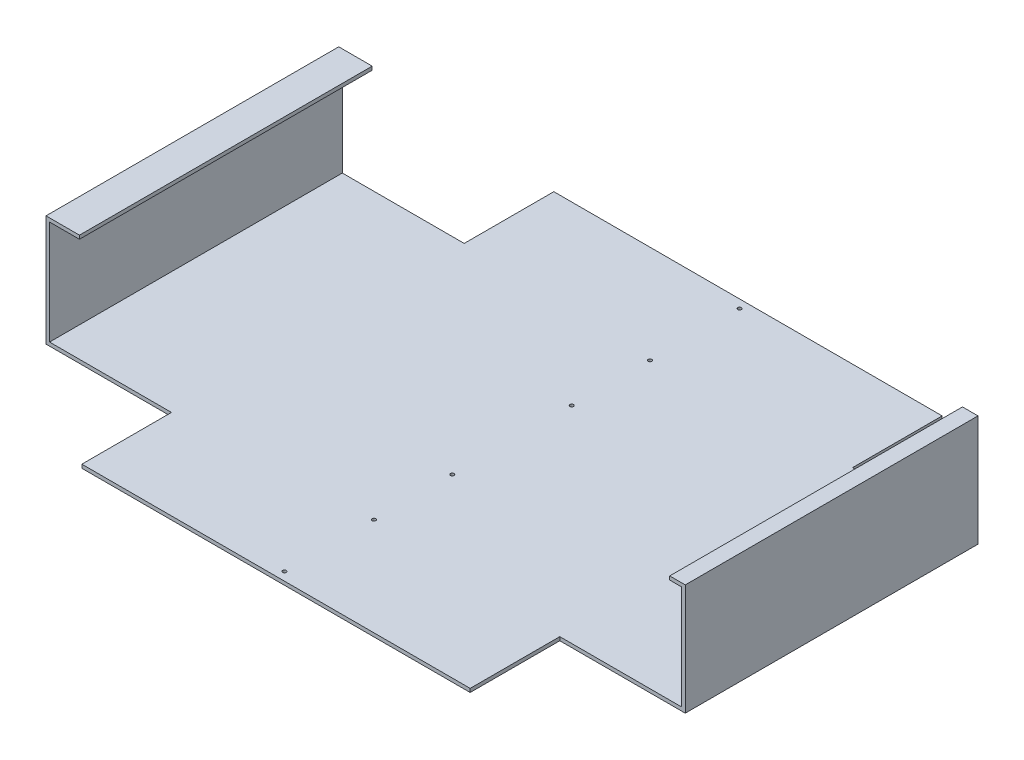
ISO-10303-21;
HEADER;
FILE_DESCRIPTION(('STEP AP214'),'2;1');
FILE_NAME('part.step','',(''),(''),'','','');
FILE_SCHEMA(('AUTOMOTIVE_DESIGN { 1 0 10303 214 1 1 1 1 }'));
ENDSEC;
DATA;
#1=APPLICATION_CONTEXT('core data for automotive mechanical design processes');
#2=APPLICATION_PROTOCOL_DEFINITION('international standard','automotive_design',2000,#1);
#3=PRODUCT_CONTEXT('',#1,'mechanical');
#4=PRODUCT('Part','Part','',(#3));
#5=PRODUCT_RELATED_PRODUCT_CATEGORY('part','',(#4));
#6=PRODUCT_DEFINITION_FORMATION('','',#4);
#7=PRODUCT_DEFINITION_CONTEXT('part definition',#1,'design');
#8=PRODUCT_DEFINITION('design','',#6,#7);
#9=PRODUCT_DEFINITION_SHAPE('','',#8);
#10=(LENGTH_UNIT() NAMED_UNIT(*) SI_UNIT(.MILLI.,.METRE.));
#11=(NAMED_UNIT(*) PLANE_ANGLE_UNIT() SI_UNIT($,.RADIAN.));
#12=(NAMED_UNIT(*) SI_UNIT($,.STERADIAN.) SOLID_ANGLE_UNIT());
#13=UNCERTAINTY_MEASURE_WITH_UNIT(LENGTH_MEASURE(1.E-05),#10,'distance_accuracy_value','');
#14=(GEOMETRIC_REPRESENTATION_CONTEXT(3) GLOBAL_UNCERTAINTY_ASSIGNED_CONTEXT((#13)) GLOBAL_UNIT_ASSIGNED_CONTEXT((#10,
#11,#12)) REPRESENTATION_CONTEXT('',''));
#15=CARTESIAN_POINT('',(0.,0.,0.));
#16=DIRECTION('',(0.,0.,1.));
#17=DIRECTION('',(1.,0.,0.));
#18=AXIS2_PLACEMENT_3D('',#15,#16,#17);
#19=CARTESIAN_POINT('',(264.5,93.,-122.5));
#20=DIRECTION('',(1.,0.,0.));
#21=DIRECTION('',(0.,0.,-1.));
#22=AXIS2_PLACEMENT_3D('',#19,#20,#21);
#23=PLANE('',#22);
#24=DIRECTION('',(0.,0.,1.));
#25=VECTOR('',#24,1.);
#26=CARTESIAN_POINT('',(264.5,90.,-122.5));
#27=LINE('',#26,#25);
#28=CARTESIAN_POINT('',(264.5,90.,-122.5));
#29=VERTEX_POINT('',#28);
#30=CARTESIAN_POINT('',(264.5,90.,122.5));
#31=VERTEX_POINT('',#30);
#32=EDGE_CURVE('E206',#29,#31,#27,.T.);
#33=ORIENTED_EDGE('',*,*,#32,.F.);
#34=DIRECTION('',(0.,-1.,0.));
#35=VECTOR('',#34,1.);
#36=CARTESIAN_POINT('',(264.5,93.,-122.5));
#37=LINE('',#36,#35);
#38=CARTESIAN_POINT('',(264.5,3.,-122.5));
#39=VERTEX_POINT('',#38);
#40=EDGE_CURVE('E211',#29,#39,#37,.T.);
#41=ORIENTED_EDGE('',*,*,#40,.T.);
#42=DIRECTION('',(0.,0.,1.));
#43=VECTOR('',#42,1.);
#44=CARTESIAN_POINT('',(264.5,3.,-122.5));
#45=LINE('',#44,#43);
#46=CARTESIAN_POINT('',(264.5,3.,122.5));
#47=VERTEX_POINT('',#46);
#48=EDGE_CURVE('E213',#39,#47,#45,.T.);
#49=ORIENTED_EDGE('',*,*,#48,.T.);
#50=DIRECTION('',(0.,-1.,0.));
#51=VECTOR('',#50,1.);
#52=CARTESIAN_POINT('',(264.5,93.,122.5));
#53=LINE('',#52,#51);
#54=EDGE_CURVE('E60',#31,#47,#53,.T.);
#55=ORIENTED_EDGE('',*,*,#54,.F.);
#56=EDGE_LOOP('',(#33,#41,#49,#55));
#57=FACE_BOUND('',#56,.T.);
#58=ADVANCED_FACE('F42',(#57),#23,.F.);
#59=CARTESIAN_POINT('',(0.,3.,0.));
#60=DIRECTION('',(0.,-1.,0.));
#61=DIRECTION('',(0.,0.,-1.));
#62=AXIS2_PLACEMENT_3D('',#59,#60,#61);
#63=PLANE('',#62);
#64=CARTESIAN_POINT('',(0.,3.,-115.5));
#65=DIRECTION('',(0.,-1.,0.));
#66=DIRECTION('',(0.,0.,-1.));
#67=AXIS2_PLACEMENT_3D('',#64,#65,#66);
#68=CIRCLE('',#67,1.5);
#69=CARTESIAN_POINT('',(0.,3.,-117.));
#70=VERTEX_POINT('',#69);
#71=EDGE_CURVE('E512',#70,#70,#68,.T.);
#72=ORIENTED_EDGE('',*,*,#71,.T.);
#73=EDGE_LOOP('',(#72));
#74=FACE_BOUND('',#73,.T.);
#75=CARTESIAN_POINT('',(0.,3.,-190.5));
#76=DIRECTION('',(0.,-1.,0.));
#77=DIRECTION('',(0.,0.,-1.));
#78=AXIS2_PLACEMENT_3D('',#75,#76,#77);
#79=CIRCLE('',#78,1.5);
#80=CARTESIAN_POINT('',(0.,3.,-192.));
#81=VERTEX_POINT('',#80);
#82=EDGE_CURVE('E504',#81,#81,#79,.T.);
#83=ORIENTED_EDGE('',*,*,#82,.T.);
#84=EDGE_LOOP('',(#83));
#85=FACE_BOUND('',#84,.T.);
#86=CARTESIAN_POINT('',(0.,3.,115.5));
#87=DIRECTION('',(0.,1.,0.));
#88=DIRECTION('',(0.,0.,1.));
#89=AXIS2_PLACEMENT_3D('',#86,#87,#88);
#90=CIRCLE('',#89,1.5);
#91=CARTESIAN_POINT('',(0.,3.,117.));
#92=VERTEX_POINT('',#91);
#93=EDGE_CURVE('E496',#92,#92,#90,.T.);
#94=ORIENTED_EDGE('',*,*,#93,.F.);
#95=EDGE_LOOP('',(#94));
#96=FACE_BOUND('',#95,.T.);
#97=CARTESIAN_POINT('',(0.,3.,190.5));
#98=DIRECTION('',(0.,1.,0.));
#99=DIRECTION('',(0.,0.,1.));
#100=AXIS2_PLACEMENT_3D('',#97,#98,#99);
#101=CIRCLE('',#100,1.5);
#102=CARTESIAN_POINT('',(0.,3.,192.));
#103=VERTEX_POINT('',#102);
#104=EDGE_CURVE('E476',#103,#103,#101,.T.);
#105=ORIENTED_EDGE('',*,*,#104,.F.);
#106=EDGE_LOOP('',(#105));
#107=FACE_BOUND('',#106,.T.);
#108=CARTESIAN_POINT('',(0.,3.,-50.));
#109=DIRECTION('',(0.,1.,0.));
#110=DIRECTION('',(0.,0.,1.));
#111=AXIS2_PLACEMENT_3D('',#108,#109,#110);
#112=CIRCLE('',#111,1.5);
#113=CARTESIAN_POINT('',(0.,3.,-48.5));
#114=VERTEX_POINT('',#113);
#115=EDGE_CURVE('E467',#114,#114,#112,.T.);
#116=ORIENTED_EDGE('',*,*,#115,.F.);
#117=EDGE_LOOP('',(#116));
#118=FACE_BOUND('',#117,.T.);
#119=CARTESIAN_POINT('',(0.,3.,50.));
#120=DIRECTION('',(0.,1.,0.));
#121=DIRECTION('',(0.,0.,1.));
#122=AXIS2_PLACEMENT_3D('',#119,#120,#121);
#123=CIRCLE('',#122,1.5);
#124=CARTESIAN_POINT('',(0.,3.,51.5));
#125=VERTEX_POINT('',#124);
#126=EDGE_CURVE('E473',#125,#125,#123,.T.);
#127=ORIENTED_EDGE('',*,*,#126,.F.);
#128=EDGE_LOOP('',(#127));
#129=FACE_BOUND('',#128,.T.);
#130=ORIENTED_EDGE('',*,*,#48,.F.);
#131=DIRECTION('',(-1.,0.,0.));
#132=VECTOR('',#131,1.);
#133=CARTESIAN_POINT('',(267.5,3.,-122.5));
#134=LINE('',#133,#132);
#135=CARTESIAN_POINT('',(162.499999999994,3.,-122.5));
#136=VERTEX_POINT('',#135);
#137=EDGE_CURVE('E310',#39,#136,#134,.T.);
#138=ORIENTED_EDGE('',*,*,#137,.T.);
#139=DIRECTION('',(0.,0.,-1.));
#140=VECTOR('',#139,1.);
#141=CARTESIAN_POINT('',(162.499999999994,3.,-197.5));
#142=LINE('',#141,#140);
#143=CARTESIAN_POINT('',(162.499999999994,3.,-197.5));
#144=VERTEX_POINT('',#143);
#145=EDGE_CURVE('E299',#136,#144,#142,.T.);
#146=ORIENTED_EDGE('',*,*,#145,.T.);
#147=DIRECTION('',(-1.,0.,0.));
#148=VECTOR('',#147,1.);
#149=CARTESIAN_POINT('',(-267.5,3.,-197.5));
#150=LINE('',#149,#148);
#151=CARTESIAN_POINT('',(-162.499999999994,3.,-197.5));
#152=VERTEX_POINT('',#151);
#153=EDGE_CURVE('E52',#144,#152,#150,.T.);
#154=ORIENTED_EDGE('',*,*,#153,.T.);
#155=DIRECTION('',(0.,0.,-1.));
#156=VECTOR('',#155,1.);
#157=CARTESIAN_POINT('',(-162.499999999994,3.,-197.5));
#158=LINE('',#157,#156);
#159=CARTESIAN_POINT('',(-162.499999999994,3.,-122.5));
#160=VERTEX_POINT('',#159);
#161=EDGE_CURVE('E358',#160,#152,#158,.T.);
#162=ORIENTED_EDGE('',*,*,#161,.F.);
#163=DIRECTION('',(1.,0.,0.));
#164=VECTOR('',#163,1.);
#165=CARTESIAN_POINT('',(-267.5,3.,-122.5));
#166=LINE('',#165,#164);
#167=CARTESIAN_POINT('',(-264.5,3.,-122.5));
#168=VERTEX_POINT('',#167);
#169=EDGE_CURVE('E346',#168,#160,#166,.T.);
#170=ORIENTED_EDGE('',*,*,#169,.F.);
#171=DIRECTION('',(0.,0.,-1.));
#172=VECTOR('',#171,1.);
#173=CARTESIAN_POINT('',(-264.5,3.,-122.5));
#174=LINE('',#173,#172);
#175=CARTESIAN_POINT('',(-264.5,3.,122.5));
#176=VERTEX_POINT('',#175);
#177=EDGE_CURVE('E261',#176,#168,#174,.T.);
#178=ORIENTED_EDGE('',*,*,#177,.F.);
#179=DIRECTION('',(1.,0.,0.));
#180=VECTOR('',#179,1.);
#181=CARTESIAN_POINT('',(-267.5,3.,122.5));
#182=LINE('',#181,#180);
#183=CARTESIAN_POINT('',(-162.499999999994,3.,122.5));
#184=VERTEX_POINT('',#183);
#185=EDGE_CURVE('E333',#176,#184,#182,.T.);
#186=ORIENTED_EDGE('',*,*,#185,.T.);
#187=DIRECTION('',(0.,0.,1.));
#188=VECTOR('',#187,1.);
#189=CARTESIAN_POINT('',(-162.499999999994,3.,197.5));
#190=LINE('',#189,#188);
#191=CARTESIAN_POINT('',(-162.499999999994,3.,197.5));
#192=VERTEX_POINT('',#191);
#193=EDGE_CURVE('E322',#184,#192,#190,.T.);
#194=ORIENTED_EDGE('',*,*,#193,.T.);
#195=DIRECTION('',(1.,0.,0.));
#196=VECTOR('',#195,1.);
#197=CARTESIAN_POINT('',(-267.5,3.,197.5));
#198=LINE('',#197,#196);
#199=CARTESIAN_POINT('',(162.499999999994,3.,197.5));
#200=VERTEX_POINT('',#199);
#201=EDGE_CURVE('E11',#192,#200,#198,.T.);
#202=ORIENTED_EDGE('',*,*,#201,.T.);
#203=DIRECTION('',(0.,0.,1.));
#204=VECTOR('',#203,1.);
#205=CARTESIAN_POINT('',(162.499999999994,3.,197.5));
#206=LINE('',#205,#204);
#207=CARTESIAN_POINT('',(162.499999999994,3.,122.5));
#208=VERTEX_POINT('',#207);
#209=EDGE_CURVE('E286',#208,#200,#206,.T.);
#210=ORIENTED_EDGE('',*,*,#209,.F.);
#211=DIRECTION('',(-1.,0.,0.));
#212=VECTOR('',#211,1.);
#213=CARTESIAN_POINT('',(267.5,3.,122.5));
#214=LINE('',#213,#212);
#215=EDGE_CURVE('E280',#47,#208,#214,.T.);
#216=ORIENTED_EDGE('',*,*,#215,.F.);
#217=EDGE_LOOP('',(#130,#138,#146,#154,#162,#170,#178,#186,#194,#202,#210,#216));
#218=FACE_BOUND('',#217,.T.);
#219=ADVANCED_FACE('F410',(#74,#85,#96,#107,#118,#129,#218),#63,.F.);
#220=CARTESIAN_POINT('',(-264.5,93.,-122.5));
#221=DIRECTION('',(-1.,0.,0.));
#222=DIRECTION('',(0.,0.,1.));
#223=AXIS2_PLACEMENT_3D('',#220,#221,#222);
#224=PLANE('',#223);
#225=DIRECTION('',(0.,0.,-1.));
#226=VECTOR('',#225,1.);
#227=CARTESIAN_POINT('',(-264.5,90.,122.5));
#228=LINE('',#227,#226);
#229=CARTESIAN_POINT('',(-264.5,90.,122.5));
#230=VERTEX_POINT('',#229);
#231=CARTESIAN_POINT('',(-264.5,90.,-122.5));
#232=VERTEX_POINT('',#231);
#233=EDGE_CURVE('E236',#230,#232,#228,.T.);
#234=ORIENTED_EDGE('',*,*,#233,.F.);
#235=DIRECTION('',(0.,-1.,0.));
#236=VECTOR('',#235,1.);
#237=CARTESIAN_POINT('',(-264.5,93.,122.5));
#238=LINE('',#237,#236);
#239=EDGE_CURVE('E68',#230,#176,#238,.T.);
#240=ORIENTED_EDGE('',*,*,#239,.T.);
#241=ORIENTED_EDGE('',*,*,#177,.T.);
#242=DIRECTION('',(0.,-1.,0.));
#243=VECTOR('',#242,1.);
#244=CARTESIAN_POINT('',(-264.5,93.,-122.5));
#245=LINE('',#244,#243);
#246=EDGE_CURVE('E273',#232,#168,#245,.T.);
#247=ORIENTED_EDGE('',*,*,#246,.F.);
#248=EDGE_LOOP('',(#234,#240,#241,#247));
#249=FACE_BOUND('',#248,.T.);
#250=ADVANCED_FACE('F437',(#249),#224,.F.);
#251=CARTESIAN_POINT('',(0.,0.,0.));
#252=DIRECTION('',(0.,-1.,0.));
#253=DIRECTION('',(0.,0.,-1.));
#254=AXIS2_PLACEMENT_3D('',#251,#252,#253);
#255=PLANE('',#254);
#256=CARTESIAN_POINT('',(0.,0.,-115.5));
#257=DIRECTION('',(0.,-1.,0.));
#258=DIRECTION('',(0.,0.,-1.));
#259=AXIS2_PLACEMENT_3D('',#256,#257,#258);
#260=CIRCLE('',#259,1.5);
#261=CARTESIAN_POINT('',(0.,0.,-117.));
#262=VERTEX_POINT('',#261);
#263=EDGE_CURVE('E508',#262,#262,#260,.T.);
#264=ORIENTED_EDGE('',*,*,#263,.F.);
#265=EDGE_LOOP('',(#264));
#266=FACE_BOUND('',#265,.T.);
#267=CARTESIAN_POINT('',(0.,0.,-190.5));
#268=DIRECTION('',(0.,-1.,0.));
#269=DIRECTION('',(0.,0.,-1.));
#270=AXIS2_PLACEMENT_3D('',#267,#268,#269);
#271=CIRCLE('',#270,1.5);
#272=CARTESIAN_POINT('',(0.,0.,-192.));
#273=VERTEX_POINT('',#272);
#274=EDGE_CURVE('E500',#273,#273,#271,.T.);
#275=ORIENTED_EDGE('',*,*,#274,.F.);
#276=EDGE_LOOP('',(#275));
#277=FACE_BOUND('',#276,.T.);
#278=CARTESIAN_POINT('',(0.,0.,115.5));
#279=DIRECTION('',(0.,1.,0.));
#280=DIRECTION('',(0.,0.,1.));
#281=AXIS2_PLACEMENT_3D('',#278,#279,#280);
#282=CIRCLE('',#281,1.5);
#283=CARTESIAN_POINT('',(0.,0.,117.));
#284=VERTEX_POINT('',#283);
#285=EDGE_CURVE('E494',#284,#284,#282,.T.);
#286=ORIENTED_EDGE('',*,*,#285,.T.);
#287=EDGE_LOOP('',(#286));
#288=FACE_BOUND('',#287,.T.);
#289=CARTESIAN_POINT('',(0.,0.,190.5));
#290=DIRECTION('',(0.,1.,0.));
#291=DIRECTION('',(0.,0.,1.));
#292=AXIS2_PLACEMENT_3D('',#289,#290,#291);
#293=CIRCLE('',#292,1.5);
#294=CARTESIAN_POINT('',(0.,0.,192.));
#295=VERTEX_POINT('',#294);
#296=EDGE_CURVE('E485',#295,#295,#293,.T.);
#297=ORIENTED_EDGE('',*,*,#296,.T.);
#298=EDGE_LOOP('',(#297));
#299=FACE_BOUND('',#298,.T.);
#300=CARTESIAN_POINT('',(0.,0.,-50.));
#301=DIRECTION('',(0.,1.,0.));
#302=DIRECTION('',(0.,0.,1.));
#303=AXIS2_PLACEMENT_3D('',#300,#301,#302);
#304=CIRCLE('',#303,1.5);
#305=CARTESIAN_POINT('',(0.,0.,-48.5));
#306=VERTEX_POINT('',#305);
#307=EDGE_CURVE('E464',#306,#306,#304,.T.);
#308=ORIENTED_EDGE('',*,*,#307,.T.);
#309=EDGE_LOOP('',(#308));
#310=FACE_BOUND('',#309,.T.);
#311=CARTESIAN_POINT('',(0.,0.,50.));
#312=DIRECTION('',(0.,1.,0.));
#313=DIRECTION('',(0.,0.,1.));
#314=AXIS2_PLACEMENT_3D('',#311,#312,#313);
#315=CIRCLE('',#314,1.5);
#316=CARTESIAN_POINT('',(0.,0.,51.5));
#317=VERTEX_POINT('',#316);
#318=EDGE_CURVE('E482',#317,#317,#315,.T.);
#319=ORIENTED_EDGE('',*,*,#318,.T.);
#320=EDGE_LOOP('',(#319));
#321=FACE_BOUND('',#320,.T.);
#322=DIRECTION('',(0.,0.,1.));
#323=VECTOR('',#322,1.);
#324=CARTESIAN_POINT('',(162.499999999994,0.,197.5));
#325=LINE('',#324,#323);
#326=CARTESIAN_POINT('',(162.499999999994,0.,122.5));
#327=VERTEX_POINT('',#326);
#328=CARTESIAN_POINT('',(162.499999999994,0.,197.5));
#329=VERTEX_POINT('',#328);
#330=EDGE_CURVE('E285',#327,#329,#325,.T.);
#331=ORIENTED_EDGE('',*,*,#330,.T.);
#332=DIRECTION('',(1.,0.,0.));
#333=VECTOR('',#332,1.);
#334=CARTESIAN_POINT('',(-267.5,0.,197.5));
#335=LINE('',#334,#333);
#336=CARTESIAN_POINT('',(-162.499999999994,0.,197.5));
#337=VERTEX_POINT('',#336);
#338=EDGE_CURVE('E46',#337,#329,#335,.T.);
#339=ORIENTED_EDGE('',*,*,#338,.F.);
#340=DIRECTION('',(0.,0.,1.));
#341=VECTOR('',#340,1.);
#342=CARTESIAN_POINT('',(-162.499999999994,0.,197.5));
#343=LINE('',#342,#341);
#344=CARTESIAN_POINT('',(-162.499999999994,0.,122.5));
#345=VERTEX_POINT('',#344);
#346=EDGE_CURVE('E329',#345,#337,#343,.T.);
#347=ORIENTED_EDGE('',*,*,#346,.F.);
#348=DIRECTION('',(1.,0.,0.));
#349=VECTOR('',#348,1.);
#350=CARTESIAN_POINT('',(-267.5,0.,122.5));
#351=LINE('',#350,#349);
#352=CARTESIAN_POINT('',(-267.5,0.,122.5));
#353=VERTEX_POINT('',#352);
#354=EDGE_CURVE('E332',#353,#345,#351,.T.);
#355=ORIENTED_EDGE('',*,*,#354,.F.);
#356=DIRECTION('',(0.,0.,1.));
#357=VECTOR('',#356,1.);
#358=CARTESIAN_POINT('',(-267.5,0.,197.5));
#359=LINE('',#358,#357);
#360=CARTESIAN_POINT('',(-267.5,0.,-122.5));
#361=VERTEX_POINT('',#360);
#362=EDGE_CURVE('E385',#361,#353,#359,.T.);
#363=ORIENTED_EDGE('',*,*,#362,.F.);
#364=DIRECTION('',(1.,0.,0.));
#365=VECTOR('',#364,1.);
#366=CARTESIAN_POINT('',(-267.5,0.,-122.5));
#367=LINE('',#366,#365);
#368=CARTESIAN_POINT('',(-162.499999999994,0.,-122.5));
#369=VERTEX_POINT('',#368);
#370=EDGE_CURVE('E353',#361,#369,#367,.T.);
#371=ORIENTED_EDGE('',*,*,#370,.T.);
#372=DIRECTION('',(0.,0.,-1.));
#373=VECTOR('',#372,1.);
#374=CARTESIAN_POINT('',(-162.499999999994,0.,-197.5));
#375=LINE('',#374,#373);
#376=CARTESIAN_POINT('',(-162.499999999994,0.,-197.5));
#377=VERTEX_POINT('',#376);
#378=EDGE_CURVE('E357',#369,#377,#375,.T.);
#379=ORIENTED_EDGE('',*,*,#378,.T.);
#380=DIRECTION('',(-1.,0.,0.));
#381=VECTOR('',#380,1.);
#382=CARTESIAN_POINT('',(-267.5,0.,-197.5));
#383=LINE('',#382,#381);
#384=CARTESIAN_POINT('',(162.499999999994,0.,-197.5));
#385=VERTEX_POINT('',#384);
#386=EDGE_CURVE('E383',#385,#377,#383,.T.);
#387=ORIENTED_EDGE('',*,*,#386,.F.);
#388=DIRECTION('',(0.,0.,-1.));
#389=VECTOR('',#388,1.);
#390=CARTESIAN_POINT('',(162.499999999994,0.,-197.5));
#391=LINE('',#390,#389);
#392=CARTESIAN_POINT('',(162.499999999994,0.,-122.5));
#393=VERTEX_POINT('',#392);
#394=EDGE_CURVE('E306',#393,#385,#391,.T.);
#395=ORIENTED_EDGE('',*,*,#394,.F.);
#396=DIRECTION('',(-1.,0.,0.));
#397=VECTOR('',#396,1.);
#398=CARTESIAN_POINT('',(267.5,0.,-122.5));
#399=LINE('',#398,#397);
#400=CARTESIAN_POINT('',(267.5,0.,-122.5));
#401=VERTEX_POINT('',#400);
#402=EDGE_CURVE('E309',#401,#393,#399,.T.);
#403=ORIENTED_EDGE('',*,*,#402,.F.);
#404=DIRECTION('',(0.,0.,-1.));
#405=VECTOR('',#404,1.);
#406=CARTESIAN_POINT('',(267.5,0.,197.5));
#407=LINE('',#406,#405);
#408=CARTESIAN_POINT('',(267.5,0.,122.5));
#409=VERTEX_POINT('',#408);
#410=EDGE_CURVE('E372',#409,#401,#407,.T.);
#411=ORIENTED_EDGE('',*,*,#410,.F.);
#412=DIRECTION('',(-1.,0.,0.));
#413=VECTOR('',#412,1.);
#414=CARTESIAN_POINT('',(267.5,0.,122.5));
#415=LINE('',#414,#413);
#416=EDGE_CURVE('E281',#409,#327,#415,.T.);
#417=ORIENTED_EDGE('',*,*,#416,.T.);
#418=EDGE_LOOP('',(#331,#339,#347,#355,#363,#371,#379,#387,#395,#403,#411,#417));
#419=FACE_BOUND('',#418,.T.);
#420=ADVANCED_FACE('F400',(#266,#277,#288,#299,#310,#321,#419),#255,.T.);
#421=CARTESIAN_POINT('',(267.5,3.,197.5));
#422=DIRECTION('',(-1.,0.,0.));
#423=DIRECTION('',(0.,0.,1.));
#424=AXIS2_PLACEMENT_3D('',#421,#422,#423);
#425=PLANE('',#424);
#426=DIRECTION('',(0.,1.,0.));
#427=VECTOR('',#426,1.);
#428=CARTESIAN_POINT('',(267.5,0.,-122.5));
#429=LINE('',#428,#427);
#430=CARTESIAN_POINT('',(267.5,93.,-122.5));
#431=VERTEX_POINT('',#430);
#432=EDGE_CURVE('E319',#401,#431,#429,.T.);
#433=ORIENTED_EDGE('',*,*,#432,.T.);
#434=DIRECTION('',(0.,0.,-1.));
#435=VECTOR('',#434,1.);
#436=CARTESIAN_POINT('',(267.5,93.,-122.5));
#437=LINE('',#436,#435);
#438=CARTESIAN_POINT('',(267.5,93.,122.5));
#439=VERTEX_POINT('',#438);
#440=EDGE_CURVE('E217',#439,#431,#437,.T.);
#441=ORIENTED_EDGE('',*,*,#440,.F.);
#442=DIRECTION('',(0.,1.,0.));
#443=VECTOR('',#442,1.);
#444=CARTESIAN_POINT('',(267.5,0.,122.5));
#445=LINE('',#444,#443);
#446=EDGE_CURVE('E290',#409,#439,#445,.T.);
#447=ORIENTED_EDGE('',*,*,#446,.F.);
#448=ORIENTED_EDGE('',*,*,#410,.T.);
#449=EDGE_LOOP('',(#433,#441,#447,#448));
#450=FACE_BOUND('',#449,.T.);
#451=ADVANCED_FACE('F44',(#450),#425,.F.);
#452=CARTESIAN_POINT('',(-267.5,3.,-197.5));
#453=DIRECTION('',(0.,0.,1.));
#454=DIRECTION('',(1.,0.,0.));
#455=AXIS2_PLACEMENT_3D('',#452,#453,#454);
#456=PLANE('',#455);
#457=DIRECTION('',(0.,1.,0.));
#458=VECTOR('',#457,1.);
#459=CARTESIAN_POINT('',(162.499999999994,0.,-197.5));
#460=LINE('',#459,#458);
#461=EDGE_CURVE('E313',#385,#144,#460,.T.);
#462=ORIENTED_EDGE('',*,*,#461,.F.);
#463=ORIENTED_EDGE('',*,*,#386,.T.);
#464=DIRECTION('',(0.,1.,0.));
#465=VECTOR('',#464,1.);
#466=CARTESIAN_POINT('',(-162.499999999994,0.,-197.5));
#467=LINE('',#466,#465);
#468=EDGE_CURVE('E368',#377,#152,#467,.T.);
#469=ORIENTED_EDGE('',*,*,#468,.T.);
#470=ORIENTED_EDGE('',*,*,#153,.F.);
#471=EDGE_LOOP('',(#462,#463,#469,#470));
#472=FACE_BOUND('',#471,.T.);
#473=ADVANCED_FACE('F445',(#472),#456,.F.);
#474=CARTESIAN_POINT('',(-267.5,3.,197.5));
#475=DIRECTION('',(1.,0.,0.));
#476=DIRECTION('',(0.,0.,-1.));
#477=AXIS2_PLACEMENT_3D('',#474,#475,#476);
#478=PLANE('',#477);
#479=DIRECTION('',(0.,1.,0.));
#480=VECTOR('',#479,1.);
#481=CARTESIAN_POINT('',(-267.5,0.,122.5));
#482=LINE('',#481,#480);
#483=CARTESIAN_POINT('',(-267.5,93.,122.5));
#484=VERTEX_POINT('',#483);
#485=EDGE_CURVE('E343',#353,#484,#482,.T.);
#486=ORIENTED_EDGE('',*,*,#485,.T.);
#487=DIRECTION('',(0.,0.,1.));
#488=VECTOR('',#487,1.);
#489=CARTESIAN_POINT('',(-267.5,93.,-122.5));
#490=LINE('',#489,#488);
#491=CARTESIAN_POINT('',(-267.5,93.,-122.5));
#492=VERTEX_POINT('',#491);
#493=EDGE_CURVE('E262',#492,#484,#490,.T.);
#494=ORIENTED_EDGE('',*,*,#493,.F.);
#495=DIRECTION('',(0.,1.,0.));
#496=VECTOR('',#495,1.);
#497=CARTESIAN_POINT('',(-267.5,0.,-122.5));
#498=LINE('',#497,#496);
#499=EDGE_CURVE('E362',#361,#492,#498,.T.);
#500=ORIENTED_EDGE('',*,*,#499,.F.);
#501=ORIENTED_EDGE('',*,*,#362,.T.);
#502=EDGE_LOOP('',(#486,#494,#500,#501));
#503=FACE_BOUND('',#502,.T.);
#504=ADVANCED_FACE('F423',(#503),#478,.F.);
#505=CARTESIAN_POINT('',(-267.5,3.,197.5));
#506=DIRECTION('',(0.,0.,-1.));
#507=DIRECTION('',(-1.,0.,0.));
#508=AXIS2_PLACEMENT_3D('',#505,#506,#507);
#509=PLANE('',#508);
#510=ORIENTED_EDGE('',*,*,#338,.T.);
#511=DIRECTION('',(0.,1.,0.));
#512=VECTOR('',#511,1.);
#513=CARTESIAN_POINT('',(162.499999999994,0.,197.5));
#514=LINE('',#513,#512);
#515=EDGE_CURVE('E295',#329,#200,#514,.T.);
#516=ORIENTED_EDGE('',*,*,#515,.T.);
#517=ORIENTED_EDGE('',*,*,#201,.F.);
#518=DIRECTION('',(0.,1.,0.));
#519=VECTOR('',#518,1.);
#520=CARTESIAN_POINT('',(-162.499999999994,0.,197.5));
#521=LINE('',#520,#519);
#522=EDGE_CURVE('E337',#337,#192,#521,.T.);
#523=ORIENTED_EDGE('',*,*,#522,.F.);
#524=EDGE_LOOP('',(#510,#516,#517,#523));
#525=FACE_BOUND('',#524,.T.);
#526=ADVANCED_FACE('F396',(#525),#509,.F.);
#527=CARTESIAN_POINT('',(-162.499999999994,0.,-197.5));
#528=DIRECTION('',(1.,0.,0.));
#529=DIRECTION('',(0.,0.,-1.));
#530=AXIS2_PLACEMENT_3D('',#527,#528,#529);
#531=PLANE('',#530);
#532=ORIENTED_EDGE('',*,*,#161,.T.);
#533=ORIENTED_EDGE('',*,*,#468,.F.);
#534=ORIENTED_EDGE('',*,*,#378,.F.);
#535=DIRECTION('',(0.,1.,0.));
#536=VECTOR('',#535,1.);
#537=CARTESIAN_POINT('',(-162.499999999994,0.,-122.5));
#538=LINE('',#537,#536);
#539=EDGE_CURVE('E373',#369,#160,#538,.T.);
#540=ORIENTED_EDGE('',*,*,#539,.T.);
#541=EDGE_LOOP('',(#532,#533,#534,#540));
#542=FACE_BOUND('',#541,.T.);
#543=ADVANCED_FACE('F440',(#542),#531,.F.);
#544=CARTESIAN_POINT('',(-267.5,0.,-122.5));
#545=DIRECTION('',(0.,0.,1.));
#546=DIRECTION('',(1.,0.,0.));
#547=AXIS2_PLACEMENT_3D('',#544,#545,#546);
#548=PLANE('',#547);
#549=ORIENTED_EDGE('',*,*,#499,.T.);
#550=DIRECTION('',(-1.,0.,0.));
#551=VECTOR('',#550,1.);
#552=CARTESIAN_POINT('',(-267.5,93.,-122.5));
#553=LINE('',#552,#551);
#554=CARTESIAN_POINT('',(-239.5,93.,-122.5));
#555=VERTEX_POINT('',#554);
#556=EDGE_CURVE('E269',#555,#492,#553,.T.);
#557=ORIENTED_EDGE('',*,*,#556,.F.);
#558=DIRECTION('',(0.,1.,0.));
#559=VECTOR('',#558,1.);
#560=CARTESIAN_POINT('',(-239.5,93.,-122.5));
#561=LINE('',#560,#559);
#562=CARTESIAN_POINT('',(-239.5,90.,-122.5));
#563=VERTEX_POINT('',#562);
#564=EDGE_CURVE('E244',#563,#555,#561,.T.);
#565=ORIENTED_EDGE('',*,*,#564,.F.);
#566=DIRECTION('',(-1.,0.,0.));
#567=VECTOR('',#566,1.);
#568=CARTESIAN_POINT('',(-239.5,90.,-122.5));
#569=LINE('',#568,#567);
#570=EDGE_CURVE('E252',#563,#232,#569,.T.);
#571=ORIENTED_EDGE('',*,*,#570,.T.);
#572=ORIENTED_EDGE('',*,*,#246,.T.);
#573=ORIENTED_EDGE('',*,*,#169,.T.);
#574=ORIENTED_EDGE('',*,*,#539,.F.);
#575=ORIENTED_EDGE('',*,*,#370,.F.);
#576=EDGE_LOOP('',(#549,#557,#565,#571,#572,#573,#574,#575));
#577=FACE_BOUND('',#576,.T.);
#578=ADVANCED_FACE('F421',(#577),#548,.F.);
#579=CARTESIAN_POINT('',(-267.5,0.,122.5));
#580=DIRECTION('',(0.,0.,1.));
#581=DIRECTION('',(1.,0.,0.));
#582=AXIS2_PLACEMENT_3D('',#579,#580,#581);
#583=PLANE('',#582);
#584=ORIENTED_EDGE('',*,*,#185,.F.);
#585=ORIENTED_EDGE('',*,*,#239,.F.);
#586=DIRECTION('',(-1.,0.,0.));
#587=VECTOR('',#586,1.);
#588=CARTESIAN_POINT('',(-239.5,90.,122.5));
#589=LINE('',#588,#587);
#590=CARTESIAN_POINT('',(-239.5,90.,122.5));
#591=VERTEX_POINT('',#590);
#592=EDGE_CURVE('E258',#591,#230,#589,.T.);
#593=ORIENTED_EDGE('',*,*,#592,.F.);
#594=DIRECTION('',(0.,-1.,0.));
#595=VECTOR('',#594,1.);
#596=CARTESIAN_POINT('',(-239.5,93.,122.5));
#597=LINE('',#596,#595);
#598=CARTESIAN_POINT('',(-239.5,93.,122.5));
#599=VERTEX_POINT('',#598);
#600=EDGE_CURVE('E237',#599,#591,#597,.T.);
#601=ORIENTED_EDGE('',*,*,#600,.F.);
#602=DIRECTION('',(1.,0.,0.));
#603=VECTOR('',#602,1.);
#604=CARTESIAN_POINT('',(-267.5,93.,122.5));
#605=LINE('',#604,#603);
#606=EDGE_CURVE('E266',#484,#599,#605,.T.);
#607=ORIENTED_EDGE('',*,*,#606,.F.);
#608=ORIENTED_EDGE('',*,*,#485,.F.);
#609=ORIENTED_EDGE('',*,*,#354,.T.);
#610=DIRECTION('',(0.,1.,0.));
#611=VECTOR('',#610,1.);
#612=CARTESIAN_POINT('',(-162.499999999994,0.,122.5));
#613=LINE('',#612,#611);
#614=EDGE_CURVE('E347',#345,#184,#613,.T.);
#615=ORIENTED_EDGE('',*,*,#614,.T.);
#616=EDGE_LOOP('',(#584,#585,#593,#601,#607,#608,#609,#615));
#617=FACE_BOUND('',#616,.T.);
#618=ADVANCED_FACE('F416',(#617),#583,.T.);
#619=CARTESIAN_POINT('',(-162.499999999994,0.,197.5));
#620=DIRECTION('',(-1.,0.,0.));
#621=DIRECTION('',(0.,0.,1.));
#622=AXIS2_PLACEMENT_3D('',#619,#620,#621);
#623=PLANE('',#622);
#624=ORIENTED_EDGE('',*,*,#193,.F.);
#625=ORIENTED_EDGE('',*,*,#614,.F.);
#626=ORIENTED_EDGE('',*,*,#346,.T.);
#627=ORIENTED_EDGE('',*,*,#522,.T.);
#628=EDGE_LOOP('',(#624,#625,#626,#627));
#629=FACE_BOUND('',#628,.T.);
#630=ADVANCED_FACE('F414',(#629),#623,.T.);
#631=CARTESIAN_POINT('',(267.5,0.,-122.5));
#632=DIRECTION('',(0.,0.,-1.));
#633=DIRECTION('',(-1.,0.,0.));
#634=AXIS2_PLACEMENT_3D('',#631,#632,#633);
#635=PLANE('',#634);
#636=ORIENTED_EDGE('',*,*,#137,.F.);
#637=ORIENTED_EDGE('',*,*,#40,.F.);
#638=DIRECTION('',(1.,0.,0.));
#639=VECTOR('',#638,1.);
#640=CARTESIAN_POINT('',(254.5,90.,-122.5));
#641=LINE('',#640,#639);
#642=CARTESIAN_POINT('',(254.5,90.,-122.5));
#643=VERTEX_POINT('',#642);
#644=EDGE_CURVE('E188',#643,#29,#641,.T.);
#645=ORIENTED_EDGE('',*,*,#644,.F.);
#646=DIRECTION('',(0.,-1.,0.));
#647=VECTOR('',#646,1.);
#648=CARTESIAN_POINT('',(254.5,93.,-122.5));
#649=LINE('',#648,#647);
#650=CARTESIAN_POINT('',(254.5,93.,-122.5));
#651=VERTEX_POINT('',#650);
#652=EDGE_CURVE('E196',#651,#643,#649,.T.);
#653=ORIENTED_EDGE('',*,*,#652,.F.);
#654=DIRECTION('',(-1.,0.,0.));
#655=VECTOR('',#654,1.);
#656=CARTESIAN_POINT('',(267.5,93.,-122.5));
#657=LINE('',#656,#655);
#658=EDGE_CURVE('E225',#431,#651,#657,.T.);
#659=ORIENTED_EDGE('',*,*,#658,.F.);
#660=ORIENTED_EDGE('',*,*,#432,.F.);
#661=ORIENTED_EDGE('',*,*,#402,.T.);
#662=DIRECTION('',(0.,1.,0.));
#663=VECTOR('',#662,1.);
#664=CARTESIAN_POINT('',(162.499999999994,0.,-122.5));
#665=LINE('',#664,#663);
#666=EDGE_CURVE('E323',#393,#136,#665,.T.);
#667=ORIENTED_EDGE('',*,*,#666,.T.);
#668=EDGE_LOOP('',(#636,#637,#645,#653,#659,#660,#661,#667));
#669=FACE_BOUND('',#668,.T.);
#670=ADVANCED_FACE('F210',(#669),#635,.T.);
#671=CARTESIAN_POINT('',(162.499999999994,0.,-197.5));
#672=DIRECTION('',(1.,0.,0.));
#673=DIRECTION('',(0.,0.,-1.));
#674=AXIS2_PLACEMENT_3D('',#671,#672,#673);
#675=PLANE('',#674);
#676=ORIENTED_EDGE('',*,*,#145,.F.);
#677=ORIENTED_EDGE('',*,*,#666,.F.);
#678=ORIENTED_EDGE('',*,*,#394,.T.);
#679=ORIENTED_EDGE('',*,*,#461,.T.);
#680=EDGE_LOOP('',(#676,#677,#678,#679));
#681=FACE_BOUND('',#680,.T.);
#682=ADVANCED_FACE('F451',(#681),#675,.T.);
#683=CARTESIAN_POINT('',(162.499999999994,0.,197.5));
#684=DIRECTION('',(-1.,0.,0.));
#685=DIRECTION('',(0.,0.,1.));
#686=AXIS2_PLACEMENT_3D('',#683,#684,#685);
#687=PLANE('',#686);
#688=ORIENTED_EDGE('',*,*,#209,.T.);
#689=ORIENTED_EDGE('',*,*,#515,.F.);
#690=ORIENTED_EDGE('',*,*,#330,.F.);
#691=DIRECTION('',(0.,1.,0.));
#692=VECTOR('',#691,1.);
#693=CARTESIAN_POINT('',(162.499999999994,0.,122.5));
#694=LINE('',#693,#692);
#695=EDGE_CURVE('E300',#327,#208,#694,.T.);
#696=ORIENTED_EDGE('',*,*,#695,.T.);
#697=EDGE_LOOP('',(#688,#689,#690,#696));
#698=FACE_BOUND('',#697,.T.);
#699=ADVANCED_FACE('F405',(#698),#687,.F.);
#700=CARTESIAN_POINT('',(267.5,0.,122.5));
#701=DIRECTION('',(0.,0.,-1.));
#702=DIRECTION('',(-1.,0.,0.));
#703=AXIS2_PLACEMENT_3D('',#700,#701,#702);
#704=PLANE('',#703);
#705=ORIENTED_EDGE('',*,*,#446,.T.);
#706=DIRECTION('',(1.,0.,0.));
#707=VECTOR('',#706,1.);
#708=CARTESIAN_POINT('',(267.5,93.,122.5));
#709=LINE('',#708,#707);
#710=CARTESIAN_POINT('',(254.5,93.,122.5));
#711=VERTEX_POINT('',#710);
#712=EDGE_CURVE('E228',#711,#439,#709,.T.);
#713=ORIENTED_EDGE('',*,*,#712,.F.);
#714=DIRECTION('',(0.,1.,0.));
#715=VECTOR('',#714,1.);
#716=CARTESIAN_POINT('',(254.5,93.,122.5));
#717=LINE('',#716,#715);
#718=CARTESIAN_POINT('',(254.5,90.,122.5));
#719=VERTEX_POINT('',#718);
#720=EDGE_CURVE('E195',#719,#711,#717,.T.);
#721=ORIENTED_EDGE('',*,*,#720,.F.);
#722=DIRECTION('',(1.,0.,0.));
#723=VECTOR('',#722,1.);
#724=CARTESIAN_POINT('',(254.5,90.,122.5));
#725=LINE('',#724,#723);
#726=EDGE_CURVE('E190',#719,#31,#725,.T.);
#727=ORIENTED_EDGE('',*,*,#726,.T.);
#728=ORIENTED_EDGE('',*,*,#54,.T.);
#729=ORIENTED_EDGE('',*,*,#215,.T.);
#730=ORIENTED_EDGE('',*,*,#695,.F.);
#731=ORIENTED_EDGE('',*,*,#416,.F.);
#732=EDGE_LOOP('',(#705,#713,#721,#727,#728,#729,#730,#731));
#733=FACE_BOUND('',#732,.T.);
#734=ADVANCED_FACE('F456',(#733),#704,.F.);
#735=CARTESIAN_POINT('',(0.,93.,0.));
#736=DIRECTION('',(0.,1.,0.));
#737=DIRECTION('',(0.,0.,1.));
#738=AXIS2_PLACEMENT_3D('',#735,#736,#737);
#739=PLANE('',#738);
#740=ORIENTED_EDGE('',*,*,#493,.T.);
#741=ORIENTED_EDGE('',*,*,#606,.T.);
#742=DIRECTION('',(0.,0.,1.));
#743=VECTOR('',#742,1.);
#744=CARTESIAN_POINT('',(-239.5,93.,122.5));
#745=LINE('',#744,#743);
#746=EDGE_CURVE('E248',#555,#599,#745,.T.);
#747=ORIENTED_EDGE('',*,*,#746,.F.);
#748=ORIENTED_EDGE('',*,*,#556,.T.);
#749=EDGE_LOOP('',(#740,#741,#747,#748));
#750=FACE_BOUND('',#749,.T.);
#751=ADVANCED_FACE('F425',(#750),#739,.T.);
#752=CARTESIAN_POINT('',(-239.5,90.,122.5));
#753=DIRECTION('',(0.,1.,0.));
#754=DIRECTION('',(0.,0.,1.));
#755=AXIS2_PLACEMENT_3D('',#752,#753,#754);
#756=PLANE('',#755);
#757=ORIENTED_EDGE('',*,*,#233,.T.);
#758=ORIENTED_EDGE('',*,*,#570,.F.);
#759=DIRECTION('',(0.,0.,-1.));
#760=VECTOR('',#759,1.);
#761=CARTESIAN_POINT('',(-239.5,90.,122.5));
#762=LINE('',#761,#760);
#763=EDGE_CURVE('E241',#591,#563,#762,.T.);
#764=ORIENTED_EDGE('',*,*,#763,.F.);
#765=ORIENTED_EDGE('',*,*,#592,.T.);
#766=EDGE_LOOP('',(#757,#758,#764,#765));
#767=FACE_BOUND('',#766,.T.);
#768=ADVANCED_FACE('F434',(#767),#756,.F.);
#769=CARTESIAN_POINT('',(-239.5,0.,0.));
#770=DIRECTION('',(1.,0.,0.));
#771=DIRECTION('',(0.,0.,-1.));
#772=AXIS2_PLACEMENT_3D('',#769,#770,#771);
#773=PLANE('',#772);
#774=ORIENTED_EDGE('',*,*,#600,.T.);
#775=ORIENTED_EDGE('',*,*,#763,.T.);
#776=ORIENTED_EDGE('',*,*,#564,.T.);
#777=ORIENTED_EDGE('',*,*,#746,.T.);
#778=EDGE_LOOP('',(#774,#775,#776,#777));
#779=FACE_BOUND('',#778,.T.);
#780=ADVANCED_FACE('F429',(#779),#773,.T.);
#781=CARTESIAN_POINT('',(0.,93.,0.));
#782=DIRECTION('',(0.,-1.,0.));
#783=DIRECTION('',(0.,0.,-1.));
#784=AXIS2_PLACEMENT_3D('',#781,#782,#783);
#785=PLANE('',#784);
#786=ORIENTED_EDGE('',*,*,#440,.T.);
#787=ORIENTED_EDGE('',*,*,#658,.T.);
#788=DIRECTION('',(0.,0.,-1.));
#789=VECTOR('',#788,1.);
#790=CARTESIAN_POINT('',(254.5,93.,-122.5));
#791=LINE('',#790,#789);
#792=EDGE_CURVE('E202',#711,#651,#791,.T.);
#793=ORIENTED_EDGE('',*,*,#792,.F.);
#794=ORIENTED_EDGE('',*,*,#712,.T.);
#795=EDGE_LOOP('',(#786,#787,#793,#794));
#796=FACE_BOUND('',#795,.T.);
#797=ADVANCED_FACE('F458',(#796),#785,.F.);
#798=CARTESIAN_POINT('',(254.5,90.,-122.5));
#799=DIRECTION('',(0.,1.,0.));
#800=DIRECTION('',(0.,0.,1.));
#801=AXIS2_PLACEMENT_3D('',#798,#799,#800);
#802=PLANE('',#801);
#803=ORIENTED_EDGE('',*,*,#32,.T.);
#804=ORIENTED_EDGE('',*,*,#726,.F.);
#805=DIRECTION('',(0.,0.,1.));
#806=VECTOR('',#805,1.);
#807=CARTESIAN_POINT('',(254.5,90.,-122.5));
#808=LINE('',#807,#806);
#809=EDGE_CURVE('E184',#643,#719,#808,.T.);
#810=ORIENTED_EDGE('',*,*,#809,.F.);
#811=ORIENTED_EDGE('',*,*,#644,.T.);
#812=EDGE_LOOP('',(#803,#804,#810,#811));
#813=FACE_BOUND('',#812,.T.);
#814=ADVANCED_FACE('F186',(#813),#802,.F.);
#815=CARTESIAN_POINT('',(254.5,0.,0.));
#816=DIRECTION('',(-1.,0.,0.));
#817=DIRECTION('',(0.,0.,1.));
#818=AXIS2_PLACEMENT_3D('',#815,#816,#817);
#819=PLANE('',#818);
#820=ORIENTED_EDGE('',*,*,#652,.T.);
#821=ORIENTED_EDGE('',*,*,#809,.T.);
#822=ORIENTED_EDGE('',*,*,#720,.T.);
#823=ORIENTED_EDGE('',*,*,#792,.T.);
#824=EDGE_LOOP('',(#820,#821,#822,#823));
#825=FACE_BOUND('',#824,.T.);
#826=ADVANCED_FACE('F200',(#825),#819,.T.);
#827=CARTESIAN_POINT('',(0.,0.,50.));
#828=DIRECTION('',(0.,1.,0.));
#829=DIRECTION('',(0.,0.,1.));
#830=AXIS2_PLACEMENT_3D('',#827,#828,#829);
#831=CYLINDRICAL_SURFACE('',#830,1.5);
#832=ORIENTED_EDGE('',*,*,#318,.F.);
#833=EDGE_LOOP('',(#832));
#834=FACE_BOUND('',#833,.T.);
#835=ORIENTED_EDGE('',*,*,#126,.T.);
#836=EDGE_LOOP('',(#835));
#837=FACE_BOUND('',#836,.T.);
#838=ADVANCED_FACE('F548',(#834,#837),#831,.F.);
#839=CARTESIAN_POINT('',(0.,0.,-50.));
#840=DIRECTION('',(0.,1.,0.));
#841=DIRECTION('',(0.,0.,1.));
#842=AXIS2_PLACEMENT_3D('',#839,#840,#841);
#843=CYLINDRICAL_SURFACE('',#842,1.5);
#844=ORIENTED_EDGE('',*,*,#307,.F.);
#845=EDGE_LOOP('',(#844));
#846=FACE_BOUND('',#845,.T.);
#847=ORIENTED_EDGE('',*,*,#115,.T.);
#848=EDGE_LOOP('',(#847));
#849=FACE_BOUND('',#848,.T.);
#850=ADVANCED_FACE('F550',(#846,#849),#843,.F.);
#851=CARTESIAN_POINT('',(0.,0.,190.5));
#852=DIRECTION('',(0.,1.,0.));
#853=DIRECTION('',(0.,0.,1.));
#854=AXIS2_PLACEMENT_3D('',#851,#852,#853);
#855=CYLINDRICAL_SURFACE('',#854,1.5);
#856=ORIENTED_EDGE('',*,*,#296,.F.);
#857=EDGE_LOOP('',(#856));
#858=FACE_BOUND('',#857,.T.);
#859=ORIENTED_EDGE('',*,*,#104,.T.);
#860=EDGE_LOOP('',(#859));
#861=FACE_BOUND('',#860,.T.);
#862=ADVANCED_FACE('F534',(#858,#861),#855,.F.);
#863=CARTESIAN_POINT('',(0.,0.,115.5));
#864=DIRECTION('',(0.,1.,0.));
#865=DIRECTION('',(0.,0.,1.));
#866=AXIS2_PLACEMENT_3D('',#863,#864,#865);
#867=CYLINDRICAL_SURFACE('',#866,1.5);
#868=ORIENTED_EDGE('',*,*,#285,.F.);
#869=EDGE_LOOP('',(#868));
#870=FACE_BOUND('',#869,.T.);
#871=ORIENTED_EDGE('',*,*,#93,.T.);
#872=EDGE_LOOP('',(#871));
#873=FACE_BOUND('',#872,.T.);
#874=ADVANCED_FACE('F530',(#870,#873),#867,.F.);
#875=CARTESIAN_POINT('',(0.,0.,-190.5));
#876=DIRECTION('',(0.,1.,0.));
#877=DIRECTION('',(0.,0.,1.));
#878=AXIS2_PLACEMENT_3D('',#875,#876,#877);
#879=CYLINDRICAL_SURFACE('',#878,1.5);
#880=ORIENTED_EDGE('',*,*,#274,.T.);
#881=EDGE_LOOP('',(#880));
#882=FACE_BOUND('',#881,.T.);
#883=ORIENTED_EDGE('',*,*,#82,.F.);
#884=EDGE_LOOP('',(#883));
#885=FACE_BOUND('',#884,.T.);
#886=ADVANCED_FACE('F533',(#882,#885),#879,.F.);
#887=CARTESIAN_POINT('',(0.,0.,-115.5));
#888=DIRECTION('',(0.,1.,0.));
#889=DIRECTION('',(0.,0.,1.));
#890=AXIS2_PLACEMENT_3D('',#887,#888,#889);
#891=CYLINDRICAL_SURFACE('',#890,1.5);
#892=ORIENTED_EDGE('',*,*,#263,.T.);
#893=EDGE_LOOP('',(#892));
#894=FACE_BOUND('',#893,.T.);
#895=ORIENTED_EDGE('',*,*,#71,.F.);
#896=EDGE_LOOP('',(#895));
#897=FACE_BOUND('',#896,.T.);
#898=ADVANCED_FACE('F520',(#894,#897),#891,.F.);
#899=CLOSED_SHELL('',(#58,#219,#250,#420,#451,#473,#504,#526,#543,#578,#618,#630,#670,#682,#699,
#734,#751,#768,#780,#797,#814,#826,#838,#850,#862,#874,#886,#898));
#900=MANIFOLD_SOLID_BREP('B2',#899);
#901=ADVANCED_BREP_SHAPE_REPRESENTATION('',(#18,#900),#14);
#902=SHAPE_DEFINITION_REPRESENTATION(#9,#901);
ENDSEC;
END-ISO-10303-21;
